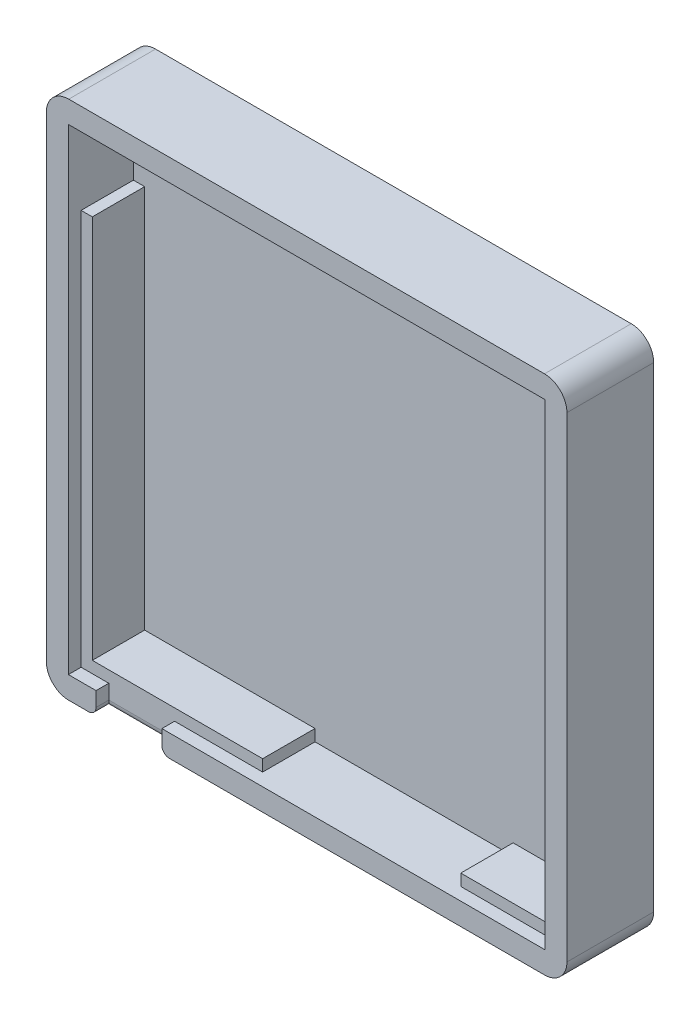
ISO-10303-21;
HEADER;
FILE_DESCRIPTION(('STEP AP214'),'2;1');
FILE_NAME('part.step','',(''),(''),'','','');
FILE_SCHEMA(('AUTOMOTIVE_DESIGN { 1 0 10303 214 1 1 1 1 }'));
ENDSEC;
DATA;
#1=APPLICATION_CONTEXT('core data for automotive mechanical design processes');
#2=APPLICATION_PROTOCOL_DEFINITION('international standard','automotive_design',2000,#1);
#3=PRODUCT_CONTEXT('',#1,'mechanical');
#4=PRODUCT('Part','Part','',(#3));
#5=PRODUCT_RELATED_PRODUCT_CATEGORY('part','',(#4));
#6=PRODUCT_DEFINITION_FORMATION('','',#4);
#7=PRODUCT_DEFINITION_CONTEXT('part definition',#1,'design');
#8=PRODUCT_DEFINITION('design','',#6,#7);
#9=PRODUCT_DEFINITION_SHAPE('','',#8);
#10=(LENGTH_UNIT() NAMED_UNIT(*) SI_UNIT(.MILLI.,.METRE.));
#11=(NAMED_UNIT(*) PLANE_ANGLE_UNIT() SI_UNIT($,.RADIAN.));
#12=(NAMED_UNIT(*) SI_UNIT($,.STERADIAN.) SOLID_ANGLE_UNIT());
#13=UNCERTAINTY_MEASURE_WITH_UNIT(LENGTH_MEASURE(1.E-05),#10,'distance_accuracy_value','');
#14=(GEOMETRIC_REPRESENTATION_CONTEXT(3) GLOBAL_UNCERTAINTY_ASSIGNED_CONTEXT((#13)) GLOBAL_UNIT_ASSIGNED_CONTEXT((#10,
#11,#12)) REPRESENTATION_CONTEXT('',''));
#15=CARTESIAN_POINT('',(0.,0.,0.));
#16=DIRECTION('',(0.,0.,1.));
#17=DIRECTION('',(1.,0.,0.));
#18=AXIS2_PLACEMENT_3D('',#15,#16,#17);
#19=CARTESIAN_POINT('',(0.,0.,9.9));
#20=DIRECTION('',(0.,0.,1.));
#21=DIRECTION('',(1.,0.,0.));
#22=AXIS2_PLACEMENT_3D('',#19,#20,#21);
#23=PLANE('',#22);
#24=DIRECTION('',(1.,0.,0.));
#25=VECTOR('',#24,1.);
#26=CARTESIAN_POINT('',(66.65,55.8474755003453,9.9));
#27=LINE('',#26,#25);
#28=CARTESIAN_POINT('',(65.15,55.8474755003453,9.9));
#29=VERTEX_POINT('',#28);
#30=CARTESIAN_POINT('',(66.65,55.8474755003453,9.9));
#31=VERTEX_POINT('',#30);
#32=EDGE_CURVE('E281',#29,#31,#27,.T.);
#33=ORIENTED_EDGE('',*,*,#32,.F.);
#34=DIRECTION('',(0.,-1.,0.));
#35=VECTOR('',#34,1.);
#36=CARTESIAN_POINT('',(65.15,65.1,9.9));
#37=LINE('',#36,#35);
#38=CARTESIAN_POINT('',(65.15,4.49999999999999,9.9));
#39=VERTEX_POINT('',#38);
#40=EDGE_CURVE('E400',#29,#39,#37,.T.);
#41=ORIENTED_EDGE('',*,*,#40,.T.);
#42=DIRECTION('',(-1.,0.,0.));
#43=VECTOR('',#42,1.);
#44=CARTESIAN_POINT('',(4.44999999999999,4.49999999999999,9.9));
#45=LINE('',#44,#43);
#46=CARTESIAN_POINT('',(53.7103472187715,4.49999999999999,9.9));
#47=VERTEX_POINT('',#46);
#48=EDGE_CURVE('E473',#39,#47,#45,.T.);
#49=ORIENTED_EDGE('',*,*,#48,.T.);
#50=DIRECTION('',(0.,1.,0.));
#51=VECTOR('',#50,1.);
#52=CARTESIAN_POINT('',(53.7103472187715,2.94999999999999,9.9));
#53=LINE('',#52,#51);
#54=CARTESIAN_POINT('',(53.7103472187715,2.94999999999999,9.9));
#55=VERTEX_POINT('',#54);
#56=EDGE_CURVE('E339',#55,#47,#53,.T.);
#57=ORIENTED_EDGE('',*,*,#56,.F.);
#58=DIRECTION('',(1.,0.,0.));
#59=VECTOR('',#58,1.);
#60=CARTESIAN_POINT('',(66.65,2.94999999999999,9.9));
#61=LINE('',#60,#59);
#62=CARTESIAN_POINT('',(66.65,2.94999999999999,9.9));
#63=VERTEX_POINT('',#62);
#64=EDGE_CURVE('E379',#55,#63,#61,.T.);
#65=ORIENTED_EDGE('',*,*,#64,.T.);
#66=DIRECTION('',(0.,1.,0.));
#67=VECTOR('',#66,1.);
#68=CARTESIAN_POINT('',(66.65,2.94999999999999,9.9));
#69=LINE('',#68,#67);
#70=EDGE_CURVE('E367',#63,#31,#69,.T.);
#71=ORIENTED_EDGE('',*,*,#70,.T.);
#72=EDGE_LOOP('',(#33,#41,#49,#57,#65,#71));
#73=FACE_BOUND('',#72,.T.);
#74=ADVANCED_FACE('F39',(#73),#23,.T.);
#75=DIRECTION('',(0.,-1.,0.));
#76=VECTOR('',#75,1.);
#77=CARTESIAN_POINT('',(56.7541359834372,66.65,9.9));
#78=LINE('',#77,#76);
#79=CARTESIAN_POINT('',(56.7541359834372,66.65,9.9));
#80=VERTEX_POINT('',#79);
#81=CARTESIAN_POINT('',(56.7541359834372,65.1,9.9));
#82=VERTEX_POINT('',#81);
#83=EDGE_CURVE('E284',#80,#82,#78,.T.);
#84=ORIENTED_EDGE('',*,*,#83,.F.);
#85=DIRECTION('',(-1.,0.,0.));
#86=VECTOR('',#85,1.);
#87=CARTESIAN_POINT('',(66.65,66.65,9.9));
#88=LINE('',#87,#86);
#89=CARTESIAN_POINT('',(13.0401484057971,66.65,9.9));
#90=VERTEX_POINT('',#89);
#91=EDGE_CURVE('E371',#80,#90,#88,.T.);
#92=ORIENTED_EDGE('',*,*,#91,.T.);
#93=DIRECTION('',(0.,1.,0.));
#94=VECTOR('',#93,1.);
#95=CARTESIAN_POINT('',(13.0401484057971,66.65,9.9));
#96=LINE('',#95,#94);
#97=CARTESIAN_POINT('',(13.0401484057971,65.1,9.9));
#98=VERTEX_POINT('',#97);
#99=EDGE_CURVE('E305',#98,#90,#96,.T.);
#100=ORIENTED_EDGE('',*,*,#99,.F.);
#101=DIRECTION('',(1.,0.,0.));
#102=VECTOR('',#101,1.);
#103=CARTESIAN_POINT('',(4.44999999999999,65.1,9.9));
#104=LINE('',#103,#102);
#105=EDGE_CURVE('E408',#98,#82,#104,.T.);
#106=ORIENTED_EDGE('',*,*,#105,.T.);
#107=EDGE_LOOP('',(#84,#92,#100,#106));
#108=FACE_BOUND('',#107,.T.);
#109=ADVANCED_FACE('F688',(#108),#23,.T.);
#110=CARTESIAN_POINT('',(4.44999999999999,4.49999999999999,2.9));
#111=DIRECTION('',(0.,-1.,0.));
#112=DIRECTION('',(0.,0.,-1.));
#113=AXIS2_PLACEMENT_3D('',#110,#111,#112);
#114=PLANE('',#113);
#115=DIRECTION('',(1.,0.,0.));
#116=VECTOR('',#115,1.);
#117=CARTESIAN_POINT('',(4.44999999999999,4.49999999999999,2.9));
#118=LINE('',#117,#116);
#119=CARTESIAN_POINT('',(53.7103472187715,4.49999999999999,2.9));
#120=VERTEX_POINT('',#119);
#121=CARTESIAN_POINT('',(65.15,4.49999999999999,2.9));
#122=VERTEX_POINT('',#121);
#123=EDGE_CURVE('E419',#120,#122,#118,.T.);
#124=ORIENTED_EDGE('',*,*,#123,.F.);
#125=DIRECTION('',(0.,0.,1.));
#126=VECTOR('',#125,1.);
#127=CARTESIAN_POINT('',(53.7103472187715,4.49999999999999,2.9));
#128=LINE('',#127,#126);
#129=EDGE_CURVE('E497',#120,#47,#128,.T.);
#130=ORIENTED_EDGE('',*,*,#129,.T.);
#131=ORIENTED_EDGE('',*,*,#48,.F.);
#132=DIRECTION('',(0.,0.,1.));
#133=VECTOR('',#132,1.);
#134=CARTESIAN_POINT('',(65.15,4.49999999999999,2.9));
#135=LINE('',#134,#133);
#136=EDGE_CURVE('E432',#122,#39,#135,.T.);
#137=ORIENTED_EDGE('',*,*,#136,.F.);
#138=EDGE_LOOP('',(#124,#130,#131,#137));
#139=FACE_BOUND('',#138,.T.);
#140=ADVANCED_FACE('F694',(#139),#114,.F.);
#141=CARTESIAN_POINT('',(66.65,2.94999999999999,9.9));
#142=DIRECTION('',(0.,-1.,0.));
#143=DIRECTION('',(1.,0.,0.));
#144=AXIS2_PLACEMENT_3D('',#141,#142,#143);
#145=PLANE('',#144);
#146=CARTESIAN_POINT('',(15.45,2.95,9.9));
#147=VERTEX_POINT('',#146);
#148=CARTESIAN_POINT('',(27.2229088198755,2.94999999999999,9.9));
#149=VERTEX_POINT('',#148);
#150=EDGE_CURVE('E383',#147,#149,#61,.T.);
#151=ORIENTED_EDGE('',*,*,#150,.F.);
#152=DIRECTION('',(0.,0.,1.));
#153=VECTOR('',#152,1.);
#154=CARTESIAN_POINT('',(15.45,2.95,9.9));
#155=LINE('',#154,#153);
#156=CARTESIAN_POINT('',(15.45,2.95,11.6));
#157=VERTEX_POINT('',#156);
#158=EDGE_CURVE('E356',#147,#157,#155,.T.);
#159=ORIENTED_EDGE('',*,*,#158,.T.);
#160=DIRECTION('',(1.,0.,0.));
#161=VECTOR('',#160,1.);
#162=CARTESIAN_POINT('',(66.65,2.94999999999999,11.6));
#163=LINE('',#162,#161);
#164=CARTESIAN_POINT('',(66.65,2.94999999999999,11.6));
#165=VERTEX_POINT('',#164);
#166=EDGE_CURVE('E393',#157,#165,#163,.T.);
#167=ORIENTED_EDGE('',*,*,#166,.T.);
#168=DIRECTION('',(0.,0.,1.));
#169=VECTOR('',#168,1.);
#170=CARTESIAN_POINT('',(66.65,2.94999999999999,9.9));
#171=LINE('',#170,#169);
#172=EDGE_CURVE('E397',#63,#165,#171,.T.);
#173=ORIENTED_EDGE('',*,*,#172,.F.);
#174=ORIENTED_EDGE('',*,*,#64,.F.);
#175=DIRECTION('',(0.,0.,1.));
#176=VECTOR('',#175,1.);
#177=CARTESIAN_POINT('',(53.7103472187715,2.94999999999999,2.9));
#178=LINE('',#177,#176);
#179=CARTESIAN_POINT('',(53.7103472187715,2.94999999999999,2.9));
#180=VERTEX_POINT('',#179);
#181=EDGE_CURVE('E319',#180,#55,#178,.T.);
#182=ORIENTED_EDGE('',*,*,#181,.F.);
#183=DIRECTION('',(1.,0.,0.));
#184=VECTOR('',#183,1.);
#185=CARTESIAN_POINT('',(53.7103472187715,2.94999999999999,2.9));
#186=LINE('',#185,#184);
#187=CARTESIAN_POINT('',(27.2229088198755,2.94999999999999,2.9));
#188=VERTEX_POINT('',#187);
#189=EDGE_CURVE('E334',#188,#180,#186,.T.);
#190=ORIENTED_EDGE('',*,*,#189,.F.);
#191=DIRECTION('',(0.,0.,1.));
#192=VECTOR('',#191,1.);
#193=CARTESIAN_POINT('',(27.2229088198755,2.94999999999999,2.9));
#194=LINE('',#193,#192);
#195=EDGE_CURVE('E338',#188,#149,#194,.T.);
#196=ORIENTED_EDGE('',*,*,#195,.T.);
#197=EDGE_LOOP('',(#151,#159,#167,#173,#174,#182,#190,#196));
#198=FACE_BOUND('',#197,.T.);
#199=ADVANCED_FACE('F718',(#198),#145,.F.);
#200=CARTESIAN_POINT('',(0.,0.,11.6));
#201=DIRECTION('',(1.,0.,0.));
#202=DIRECTION('',(0.,0.,-1.));
#203=AXIS2_PLACEMENT_3D('',#200,#201,#202);
#204=PLANE('',#203);
#205=DIRECTION('',(0.,-1.,0.));
#206=VECTOR('',#205,1.);
#207=CARTESIAN_POINT('',(0.,0.,11.6));
#208=LINE('',#207,#206);
#209=CARTESIAN_POINT('',(0.,66.6,11.6));
#210=VERTEX_POINT('',#209);
#211=CARTESIAN_POINT('',(0.,3.,11.6));
#212=VERTEX_POINT('',#211);
#213=EDGE_CURVE('E440',#210,#212,#208,.T.);
#214=ORIENTED_EDGE('',*,*,#213,.F.);
#215=DIRECTION('',(0.,0.,-1.));
#216=VECTOR('',#215,1.);
#217=CARTESIAN_POINT('',(0.,66.6,11.6));
#218=LINE('',#217,#216);
#219=CARTESIAN_POINT('',(0.,66.6,0.));
#220=VERTEX_POINT('',#219);
#221=EDGE_CURVE('E542',#210,#220,#218,.T.);
#222=ORIENTED_EDGE('',*,*,#221,.T.);
#223=DIRECTION('',(0.,-1.,0.));
#224=VECTOR('',#223,1.);
#225=CARTESIAN_POINT('',(0.,0.,0.));
#226=LINE('',#225,#224);
#227=CARTESIAN_POINT('',(0.,3.,0.));
#228=VERTEX_POINT('',#227);
#229=EDGE_CURVE('E436',#220,#228,#226,.T.);
#230=ORIENTED_EDGE('',*,*,#229,.T.);
#231=DIRECTION('',(0.,0.,-1.));
#232=VECTOR('',#231,1.);
#233=CARTESIAN_POINT('',(0.,3.,11.6));
#234=LINE('',#233,#232);
#235=EDGE_CURVE('E539',#228,#212,#234,.F.);
#236=ORIENTED_EDGE('',*,*,#235,.T.);
#237=EDGE_LOOP('',(#214,#222,#230,#236));
#238=FACE_BOUND('',#237,.T.);
#239=ADVANCED_FACE('F663',(#238),#204,.F.);
#240=CARTESIAN_POINT('',(0.,0.,11.6));
#241=DIRECTION('',(0.,1.,0.));
#242=DIRECTION('',(0.,0.,1.));
#243=AXIS2_PLACEMENT_3D('',#240,#241,#242);
#244=PLANE('',#243);
#245=DIRECTION('',(1.,0.,0.));
#246=VECTOR('',#245,1.);
#247=CARTESIAN_POINT('',(6.65,0.,8.9));
#248=LINE('',#247,#246);
#249=CARTESIAN_POINT('',(16.45,0.,8.9));
#250=VERTEX_POINT('',#249);
#251=CARTESIAN_POINT('',(5.65,0.,8.9));
#252=VERTEX_POINT('',#251);
#253=EDGE_CURVE('E557',#250,#252,#248,.F.);
#254=ORIENTED_EDGE('',*,*,#253,.T.);
#255=DIRECTION('',(0.,0.,1.));
#256=VECTOR('',#255,1.);
#257=CARTESIAN_POINT('',(5.65,0.,11.6));
#258=LINE('',#257,#256);
#259=CARTESIAN_POINT('',(5.65,0.,11.6));
#260=VERTEX_POINT('',#259);
#261=EDGE_CURVE('E560',#252,#260,#258,.T.);
#262=ORIENTED_EDGE('',*,*,#261,.T.);
#263=DIRECTION('',(1.,0.,0.));
#264=VECTOR('',#263,1.);
#265=CARTESIAN_POINT('',(0.,0.,11.6));
#266=LINE('',#265,#264);
#267=CARTESIAN_POINT('',(3.,0.,11.6));
#268=VERTEX_POINT('',#267);
#269=EDGE_CURVE('E446',#268,#260,#266,.T.);
#270=ORIENTED_EDGE('',*,*,#269,.F.);
#271=DIRECTION('',(0.,0.,-1.));
#272=VECTOR('',#271,1.);
#273=CARTESIAN_POINT('',(3.,0.,11.6));
#274=LINE('',#273,#272);
#275=CARTESIAN_POINT('',(3.,0.,0.));
#276=VERTEX_POINT('',#275);
#277=EDGE_CURVE('E550',#268,#276,#274,.T.);
#278=ORIENTED_EDGE('',*,*,#277,.T.);
#279=DIRECTION('',(1.,0.,0.));
#280=VECTOR('',#279,1.);
#281=CARTESIAN_POINT('',(0.,0.,0.));
#282=LINE('',#281,#280);
#283=CARTESIAN_POINT('',(66.6,0.,0.));
#284=VERTEX_POINT('',#283);
#285=EDGE_CURVE('E462',#276,#284,#282,.T.);
#286=ORIENTED_EDGE('',*,*,#285,.T.);
#287=DIRECTION('',(0.,0.,-1.));
#288=VECTOR('',#287,1.);
#289=CARTESIAN_POINT('',(66.6,0.,11.6));
#290=LINE('',#289,#288);
#291=CARTESIAN_POINT('',(66.6,0.,11.6));
#292=VERTEX_POINT('',#291);
#293=EDGE_CURVE('E546',#284,#292,#290,.F.);
#294=ORIENTED_EDGE('',*,*,#293,.T.);
#295=CARTESIAN_POINT('',(16.45,0.,11.6));
#296=VERTEX_POINT('',#295);
#297=EDGE_CURVE('E444',#296,#292,#266,.T.);
#298=ORIENTED_EDGE('',*,*,#297,.F.);
#299=DIRECTION('',(0.,0.,1.));
#300=VECTOR('',#299,1.);
#301=CARTESIAN_POINT('',(16.45,0.,11.6));
#302=LINE('',#301,#300);
#303=EDGE_CURVE('E554',#296,#250,#302,.F.);
#304=ORIENTED_EDGE('',*,*,#303,.T.);
#305=EDGE_LOOP('',(#254,#262,#270,#278,#286,#294,#298,#304));
#306=FACE_BOUND('',#305,.T.);
#307=ADVANCED_FACE('F639',(#306),#244,.F.);
#308=CARTESIAN_POINT('',(69.6,0.,11.6));
#309=DIRECTION('',(-1.,0.,0.));
#310=DIRECTION('',(0.,0.,1.));
#311=AXIS2_PLACEMENT_3D('',#308,#309,#310);
#312=PLANE('',#311);
#313=DIRECTION('',(0.,1.,0.));
#314=VECTOR('',#313,1.);
#315=CARTESIAN_POINT('',(69.6,0.,0.));
#316=LINE('',#315,#314);
#317=CARTESIAN_POINT('',(69.6,3.,0.));
#318=VERTEX_POINT('',#317);
#319=CARTESIAN_POINT('',(69.6,66.6,0.));
#320=VERTEX_POINT('',#319);
#321=EDGE_CURVE('E466',#318,#320,#316,.T.);
#322=ORIENTED_EDGE('',*,*,#321,.T.);
#323=DIRECTION('',(0.,0.,-1.));
#324=VECTOR('',#323,1.);
#325=CARTESIAN_POINT('',(69.6,66.6,11.6));
#326=LINE('',#325,#324);
#327=CARTESIAN_POINT('',(69.6,66.6,11.6));
#328=VERTEX_POINT('',#327);
#329=EDGE_CURVE('E524',#320,#328,#326,.F.);
#330=ORIENTED_EDGE('',*,*,#329,.T.);
#331=DIRECTION('',(0.,1.,0.));
#332=VECTOR('',#331,1.);
#333=CARTESIAN_POINT('',(69.6,0.,11.6));
#334=LINE('',#333,#332);
#335=CARTESIAN_POINT('',(69.6,3.,11.6));
#336=VERTEX_POINT('',#335);
#337=EDGE_CURVE('E450',#336,#328,#334,.T.);
#338=ORIENTED_EDGE('',*,*,#337,.F.);
#339=DIRECTION('',(0.,0.,-1.));
#340=VECTOR('',#339,1.);
#341=CARTESIAN_POINT('',(69.6,3.,11.6));
#342=LINE('',#341,#340);
#343=EDGE_CURVE('E520',#336,#318,#342,.T.);
#344=ORIENTED_EDGE('',*,*,#343,.T.);
#345=EDGE_LOOP('',(#322,#330,#338,#344));
#346=FACE_BOUND('',#345,.T.);
#347=ADVANCED_FACE('F648',(#346),#312,.F.);
#348=CARTESIAN_POINT('',(0.,69.6,11.6));
#349=DIRECTION('',(0.,-1.,0.));
#350=DIRECTION('',(0.,0.,-1.));
#351=AXIS2_PLACEMENT_3D('',#348,#349,#350);
#352=PLANE('',#351);
#353=DIRECTION('',(-1.,0.,0.));
#354=VECTOR('',#353,1.);
#355=CARTESIAN_POINT('',(0.,69.6,11.6));
#356=LINE('',#355,#354);
#357=CARTESIAN_POINT('',(66.6,69.6,11.6));
#358=VERTEX_POINT('',#357);
#359=CARTESIAN_POINT('',(3.,69.6,11.6));
#360=VERTEX_POINT('',#359);
#361=EDGE_CURVE('E454',#358,#360,#356,.T.);
#362=ORIENTED_EDGE('',*,*,#361,.F.);
#363=DIRECTION('',(0.,0.,-1.));
#364=VECTOR('',#363,1.);
#365=CARTESIAN_POINT('',(66.6,69.6,11.6));
#366=LINE('',#365,#364);
#367=CARTESIAN_POINT('',(66.6,69.6,0.));
#368=VERTEX_POINT('',#367);
#369=EDGE_CURVE('E504',#358,#368,#366,.T.);
#370=ORIENTED_EDGE('',*,*,#369,.T.);
#371=DIRECTION('',(-1.,0.,0.));
#372=VECTOR('',#371,1.);
#373=CARTESIAN_POINT('',(0.,69.6,0.));
#374=LINE('',#373,#372);
#375=CARTESIAN_POINT('',(3.,69.6,0.));
#376=VERTEX_POINT('',#375);
#377=EDGE_CURVE('E445',#368,#376,#374,.T.);
#378=ORIENTED_EDGE('',*,*,#377,.T.);
#379=DIRECTION('',(0.,0.,-1.));
#380=VECTOR('',#379,1.);
#381=CARTESIAN_POINT('',(3.,69.6,11.6));
#382=LINE('',#381,#380);
#383=EDGE_CURVE('E501',#376,#360,#382,.F.);
#384=ORIENTED_EDGE('',*,*,#383,.T.);
#385=EDGE_LOOP('',(#362,#370,#378,#384));
#386=FACE_BOUND('',#385,.T.);
#387=ADVANCED_FACE('F671',(#386),#352,.F.);
#388=CARTESIAN_POINT('',(0.,0.,11.6));
#389=DIRECTION('',(0.,0.,-1.));
#390=DIRECTION('',(-1.,0.,0.));
#391=AXIS2_PLACEMENT_3D('',#388,#389,#390);
#392=PLANE('',#391);
#393=ORIENTED_EDGE('',*,*,#269,.T.);
#394=CARTESIAN_POINT('',(5.65,1.,11.6));
#395=DIRECTION('',(0.,0.,-1.));
#396=DIRECTION('',(-1.,0.,0.));
#397=AXIS2_PLACEMENT_3D('',#394,#395,#396);
#398=CIRCLE('',#397,1.);
#399=CARTESIAN_POINT('',(6.65,1.,11.6));
#400=VERTEX_POINT('',#399);
#401=EDGE_CURVE('E567',#260,#400,#398,.F.);
#402=ORIENTED_EDGE('',*,*,#401,.T.);
#403=DIRECTION('',(0.,-1.,0.));
#404=VECTOR('',#403,1.);
#405=CARTESIAN_POINT('',(6.65,2.95,11.6));
#406=LINE('',#405,#404);
#407=CARTESIAN_POINT('',(6.65,2.95,11.6));
#408=VERTEX_POINT('',#407);
#409=EDGE_CURVE('E353',#408,#400,#406,.T.);
#410=ORIENTED_EDGE('',*,*,#409,.F.);
#411=CARTESIAN_POINT('',(2.95,2.95,11.6));
#412=VERTEX_POINT('',#411);
#413=EDGE_CURVE('E372',#412,#408,#163,.T.);
#414=ORIENTED_EDGE('',*,*,#413,.F.);
#415=DIRECTION('',(0.,-1.,0.));
#416=VECTOR('',#415,1.);
#417=CARTESIAN_POINT('',(2.95,2.95,11.6));
#418=LINE('',#417,#416);
#419=CARTESIAN_POINT('',(2.95,66.65,11.6));
#420=VERTEX_POINT('',#419);
#421=EDGE_CURVE('E389',#420,#412,#418,.T.);
#422=ORIENTED_EDGE('',*,*,#421,.F.);
#423=DIRECTION('',(-1.,0.,0.));
#424=VECTOR('',#423,1.);
#425=CARTESIAN_POINT('',(66.65,66.65,11.6));
#426=LINE('',#425,#424);
#427=CARTESIAN_POINT('',(66.65,66.65,11.6));
#428=VERTEX_POINT('',#427);
#429=EDGE_CURVE('E386',#428,#420,#426,.T.);
#430=ORIENTED_EDGE('',*,*,#429,.F.);
#431=DIRECTION('',(0.,1.,0.));
#432=VECTOR('',#431,1.);
#433=CARTESIAN_POINT('',(66.65,2.94999999999999,11.6));
#434=LINE('',#433,#432);
#435=EDGE_CURVE('E258',#165,#428,#434,.T.);
#436=ORIENTED_EDGE('',*,*,#435,.F.);
#437=ORIENTED_EDGE('',*,*,#166,.F.);
#438=DIRECTION('',(0.,1.,0.));
#439=VECTOR('',#438,1.);
#440=CARTESIAN_POINT('',(15.45,2.95,11.6));
#441=LINE('',#440,#439);
#442=CARTESIAN_POINT('',(15.45,0.999999999999999,11.6));
#443=VERTEX_POINT('',#442);
#444=EDGE_CURVE('E297',#443,#157,#441,.T.);
#445=ORIENTED_EDGE('',*,*,#444,.F.);
#446=CARTESIAN_POINT('',(16.45,1.,11.6));
#447=DIRECTION('',(0.,0.,-1.));
#448=DIRECTION('',(-1.,0.,0.));
#449=AXIS2_PLACEMENT_3D('',#446,#447,#448);
#450=CIRCLE('',#449,1.);
#451=EDGE_CURVE('E564',#443,#296,#450,.F.);
#452=ORIENTED_EDGE('',*,*,#451,.T.);
#453=ORIENTED_EDGE('',*,*,#297,.T.);
#454=CARTESIAN_POINT('',(66.6,3.,11.6));
#455=DIRECTION('',(0.,0.,-1.));
#456=DIRECTION('',(-1.,0.,0.));
#457=AXIS2_PLACEMENT_3D('',#454,#455,#456);
#458=CIRCLE('',#457,3.);
#459=EDGE_CURVE('E527',#292,#336,#458,.F.);
#460=ORIENTED_EDGE('',*,*,#459,.T.);
#461=ORIENTED_EDGE('',*,*,#337,.T.);
#462=CARTESIAN_POINT('',(66.6,66.6,11.6));
#463=DIRECTION('',(0.,0.,-1.));
#464=DIRECTION('',(-1.,0.,0.));
#465=AXIS2_PLACEMENT_3D('',#462,#463,#464);
#466=CIRCLE('',#465,3.);
#467=EDGE_CURVE('E536',#328,#358,#466,.F.);
#468=ORIENTED_EDGE('',*,*,#467,.T.);
#469=ORIENTED_EDGE('',*,*,#361,.T.);
#470=CARTESIAN_POINT('',(3.,66.6,11.6));
#471=DIRECTION('',(0.,0.,-1.));
#472=DIRECTION('',(-1.,0.,0.));
#473=AXIS2_PLACEMENT_3D('',#470,#471,#472);
#474=CIRCLE('',#473,3.);
#475=EDGE_CURVE('E533',#360,#210,#474,.F.);
#476=ORIENTED_EDGE('',*,*,#475,.T.);
#477=ORIENTED_EDGE('',*,*,#213,.T.);
#478=CARTESIAN_POINT('',(3.,3.,11.6));
#479=DIRECTION('',(0.,0.,-1.));
#480=DIRECTION('',(-1.,0.,0.));
#481=AXIS2_PLACEMENT_3D('',#478,#479,#480);
#482=CIRCLE('',#481,3.);
#483=EDGE_CURVE('E530',#212,#268,#482,.F.);
#484=ORIENTED_EDGE('',*,*,#483,.T.);
#485=EDGE_LOOP('',(#393,#402,#410,#414,#422,#430,#436,#437,#445,#452,#453,#460,#461,#468,#469,
#476,#477,#484));
#486=FACE_BOUND('',#485,.T.);
#487=ADVANCED_FACE('F595',(#486),#392,.F.);
#488=CARTESIAN_POINT('',(0.,0.,0.));
#489=DIRECTION('',(0.,0.,-1.));
#490=DIRECTION('',(-1.,0.,0.));
#491=AXIS2_PLACEMENT_3D('',#488,#489,#490);
#492=PLANE('',#491);
#493=ORIENTED_EDGE('',*,*,#377,.F.);
#494=CARTESIAN_POINT('',(66.6,66.6,0.));
#495=DIRECTION('',(0.,0.,-1.));
#496=DIRECTION('',(-1.,0.,0.));
#497=AXIS2_PLACEMENT_3D('',#494,#495,#496);
#498=CIRCLE('',#497,3.);
#499=EDGE_CURVE('E517',#368,#320,#498,.T.);
#500=ORIENTED_EDGE('',*,*,#499,.T.);
#501=ORIENTED_EDGE('',*,*,#321,.F.);
#502=CARTESIAN_POINT('',(66.6,3.,0.));
#503=DIRECTION('',(0.,0.,-1.));
#504=DIRECTION('',(-1.,0.,0.));
#505=AXIS2_PLACEMENT_3D('',#502,#503,#504);
#506=CIRCLE('',#505,3.);
#507=EDGE_CURVE('E508',#318,#284,#506,.T.);
#508=ORIENTED_EDGE('',*,*,#507,.T.);
#509=ORIENTED_EDGE('',*,*,#285,.F.);
#510=CARTESIAN_POINT('',(3.,3.,0.));
#511=DIRECTION('',(0.,0.,-1.));
#512=DIRECTION('',(-1.,0.,0.));
#513=AXIS2_PLACEMENT_3D('',#510,#511,#512);
#514=CIRCLE('',#513,3.);
#515=EDGE_CURVE('E511',#276,#228,#514,.T.);
#516=ORIENTED_EDGE('',*,*,#515,.T.);
#517=ORIENTED_EDGE('',*,*,#229,.F.);
#518=CARTESIAN_POINT('',(3.,66.6,0.));
#519=DIRECTION('',(0.,0.,-1.));
#520=DIRECTION('',(-1.,0.,0.));
#521=AXIS2_PLACEMENT_3D('',#518,#519,#520);
#522=CIRCLE('',#521,3.);
#523=EDGE_CURVE('E514',#220,#376,#522,.T.);
#524=ORIENTED_EDGE('',*,*,#523,.T.);
#525=EDGE_LOOP('',(#493,#500,#501,#508,#509,#516,#517,#524));
#526=FACE_BOUND('',#525,.T.);
#527=ADVANCED_FACE('F655',(#526),#492,.T.);
#528=DIRECTION('',(0.,-1.,0.));
#529=VECTOR('',#528,1.);
#530=CARTESIAN_POINT('',(6.65,2.95,9.9));
#531=LINE('',#530,#529);
#532=CARTESIAN_POINT('',(6.65,2.95,9.9));
#533=VERTEX_POINT('',#532);
#534=CARTESIAN_POINT('',(6.65,1.,9.9));
#535=VERTEX_POINT('',#534);
#536=EDGE_CURVE('E352',#533,#535,#531,.T.);
#537=ORIENTED_EDGE('',*,*,#536,.T.);
#538=DIRECTION('',(1.,0.,0.));
#539=VECTOR('',#538,1.);
#540=CARTESIAN_POINT('',(15.45,1.,9.9));
#541=LINE('',#540,#539);
#542=CARTESIAN_POINT('',(15.45,0.999999999999999,9.9));
#543=VERTEX_POINT('',#542);
#544=EDGE_CURVE('E49',#535,#543,#541,.T.);
#545=ORIENTED_EDGE('',*,*,#544,.T.);
#546=DIRECTION('',(0.,1.,0.));
#547=VECTOR('',#546,1.);
#548=CARTESIAN_POINT('',(15.45,2.95,9.9));
#549=LINE('',#548,#547);
#550=EDGE_CURVE('E349',#543,#147,#549,.T.);
#551=ORIENTED_EDGE('',*,*,#550,.T.);
#552=ORIENTED_EDGE('',*,*,#150,.T.);
#553=DIRECTION('',(0.,-1.,0.));
#554=VECTOR('',#553,1.);
#555=CARTESIAN_POINT('',(27.2229088198755,2.94999999999999,9.9));
#556=LINE('',#555,#554);
#557=CARTESIAN_POINT('',(27.2229088198755,4.49999999999999,9.9));
#558=VERTEX_POINT('',#557);
#559=EDGE_CURVE('E331',#558,#149,#556,.T.);
#560=ORIENTED_EDGE('',*,*,#559,.F.);
#561=CARTESIAN_POINT('',(4.44999999999999,4.49999999999999,9.9));
#562=VERTEX_POINT('',#561);
#563=EDGE_CURVE('E458',#558,#562,#45,.T.);
#564=ORIENTED_EDGE('',*,*,#563,.T.);
#565=DIRECTION('',(0.,1.,0.));
#566=VECTOR('',#565,1.);
#567=CARTESIAN_POINT('',(4.44999999999999,65.1,9.9));
#568=LINE('',#567,#566);
#569=CARTESIAN_POINT('',(4.44999999999999,55.8474755003453,9.9));
#570=VERTEX_POINT('',#569);
#571=EDGE_CURVE('E412',#562,#570,#568,.T.);
#572=ORIENTED_EDGE('',*,*,#571,.T.);
#573=DIRECTION('',(1.,0.,0.));
#574=VECTOR('',#573,1.);
#575=CARTESIAN_POINT('',(2.95,55.8474755003453,9.9));
#576=LINE('',#575,#574);
#577=CARTESIAN_POINT('',(2.95,55.8474755003453,9.9));
#578=VERTEX_POINT('',#577);
#579=EDGE_CURVE('E316',#578,#570,#576,.T.);
#580=ORIENTED_EDGE('',*,*,#579,.F.);
#581=DIRECTION('',(0.,-1.,0.));
#582=VECTOR('',#581,1.);
#583=CARTESIAN_POINT('',(2.95,2.95,9.9));
#584=LINE('',#583,#582);
#585=CARTESIAN_POINT('',(2.95,2.95,9.9));
#586=VERTEX_POINT('',#585);
#587=EDGE_CURVE('E376',#578,#586,#584,.T.);
#588=ORIENTED_EDGE('',*,*,#587,.T.);
#589=EDGE_CURVE('E264',#586,#533,#61,.T.);
#590=ORIENTED_EDGE('',*,*,#589,.T.);
#591=EDGE_LOOP('',(#537,#545,#551,#552,#560,#564,#572,#580,#588,#590));
#592=FACE_BOUND('',#591,.T.);
#593=ADVANCED_FACE('F609',(#592),#23,.T.);
#594=CARTESIAN_POINT('',(66.65,2.94999999999999,9.9));
#595=DIRECTION('',(1.,0.,0.));
#596=DIRECTION('',(0.,0.,-1.));
#597=AXIS2_PLACEMENT_3D('',#594,#595,#596);
#598=PLANE('',#597);
#599=ORIENTED_EDGE('',*,*,#435,.T.);
#600=DIRECTION('',(0.,0.,1.));
#601=VECTOR('',#600,1.);
#602=CARTESIAN_POINT('',(66.65,66.65,9.9));
#603=LINE('',#602,#601);
#604=CARTESIAN_POINT('',(66.65,66.65,2.9));
#605=VERTEX_POINT('',#604);
#606=EDGE_CURVE('E250',#605,#428,#603,.T.);
#607=ORIENTED_EDGE('',*,*,#606,.F.);
#608=DIRECTION('',(0.,1.,0.));
#609=VECTOR('',#608,1.);
#610=CARTESIAN_POINT('',(66.65,66.65,2.9));
#611=LINE('',#610,#609);
#612=CARTESIAN_POINT('',(66.65,55.8474755003453,2.9));
#613=VERTEX_POINT('',#612);
#614=EDGE_CURVE('E255',#613,#605,#611,.T.);
#615=ORIENTED_EDGE('',*,*,#614,.F.);
#616=DIRECTION('',(0.,0.,1.));
#617=VECTOR('',#616,1.);
#618=CARTESIAN_POINT('',(66.65,55.8474755003453,2.9));
#619=LINE('',#618,#617);
#620=EDGE_CURVE('E294',#613,#31,#619,.T.);
#621=ORIENTED_EDGE('',*,*,#620,.T.);
#622=ORIENTED_EDGE('',*,*,#70,.F.);
#623=ORIENTED_EDGE('',*,*,#172,.T.);
#624=EDGE_LOOP('',(#599,#607,#615,#621,#622,#623));
#625=FACE_BOUND('',#624,.T.);
#626=ADVANCED_FACE('F252',(#625),#598,.F.);
#627=ORIENTED_EDGE('',*,*,#413,.T.);
#628=DIRECTION('',(0.,0.,1.));
#629=VECTOR('',#628,1.);
#630=CARTESIAN_POINT('',(6.65,2.95,9.9));
#631=LINE('',#630,#629);
#632=EDGE_CURVE('E361',#533,#408,#631,.T.);
#633=ORIENTED_EDGE('',*,*,#632,.F.);
#634=ORIENTED_EDGE('',*,*,#589,.F.);
#635=DIRECTION('',(0.,0.,1.));
#636=VECTOR('',#635,1.);
#637=CARTESIAN_POINT('',(2.95,2.95,9.9));
#638=LINE('',#637,#636);
#639=EDGE_CURVE('E401',#586,#412,#638,.T.);
#640=ORIENTED_EDGE('',*,*,#639,.T.);
#641=EDGE_LOOP('',(#627,#633,#634,#640));
#642=FACE_BOUND('',#641,.T.);
#643=ADVANCED_FACE('F633',(#642),#145,.F.);
#644=CARTESIAN_POINT('',(2.95,2.95,9.9));
#645=DIRECTION('',(-1.,0.,0.));
#646=DIRECTION('',(0.,0.,1.));
#647=AXIS2_PLACEMENT_3D('',#644,#645,#646);
#648=PLANE('',#647);
#649=ORIENTED_EDGE('',*,*,#421,.T.);
#650=ORIENTED_EDGE('',*,*,#639,.F.);
#651=ORIENTED_EDGE('',*,*,#587,.F.);
#652=DIRECTION('',(0.,0.,1.));
#653=VECTOR('',#652,1.);
#654=CARTESIAN_POINT('',(2.95,55.8474755003453,2.9));
#655=LINE('',#654,#653);
#656=CARTESIAN_POINT('',(2.95,55.8474755003453,2.9));
#657=VERTEX_POINT('',#656);
#658=EDGE_CURVE('E315',#657,#578,#655,.T.);
#659=ORIENTED_EDGE('',*,*,#658,.F.);
#660=DIRECTION('',(0.,-1.,0.));
#661=VECTOR('',#660,1.);
#662=CARTESIAN_POINT('',(2.95,66.65,2.9));
#663=LINE('',#662,#661);
#664=CARTESIAN_POINT('',(2.95,66.65,2.9));
#665=VERTEX_POINT('',#664);
#666=EDGE_CURVE('E300',#665,#657,#663,.T.);
#667=ORIENTED_EDGE('',*,*,#666,.F.);
#668=DIRECTION('',(0.,0.,1.));
#669=VECTOR('',#668,1.);
#670=CARTESIAN_POINT('',(2.95,66.65,9.9));
#671=LINE('',#670,#669);
#672=EDGE_CURVE('E263',#665,#420,#671,.T.);
#673=ORIENTED_EDGE('',*,*,#672,.T.);
#674=EDGE_LOOP('',(#649,#650,#651,#659,#667,#673));
#675=FACE_BOUND('',#674,.T.);
#676=ADVANCED_FACE('F627',(#675),#648,.F.);
#677=CARTESIAN_POINT('',(66.65,66.65,9.9));
#678=DIRECTION('',(0.,1.,0.));
#679=DIRECTION('',(-1.,0.,0.));
#680=AXIS2_PLACEMENT_3D('',#677,#678,#679);
#681=PLANE('',#680);
#682=ORIENTED_EDGE('',*,*,#429,.T.);
#683=ORIENTED_EDGE('',*,*,#672,.F.);
#684=DIRECTION('',(-1.,0.,0.));
#685=VECTOR('',#684,1.);
#686=CARTESIAN_POINT('',(2.95,66.65,2.9));
#687=LINE('',#686,#685);
#688=CARTESIAN_POINT('',(13.0401484057971,66.65,2.9));
#689=VERTEX_POINT('',#688);
#690=EDGE_CURVE('E311',#689,#665,#687,.T.);
#691=ORIENTED_EDGE('',*,*,#690,.F.);
#692=DIRECTION('',(0.,0.,1.));
#693=VECTOR('',#692,1.);
#694=CARTESIAN_POINT('',(13.0401484057971,66.65,2.9));
#695=LINE('',#694,#693);
#696=EDGE_CURVE('E292',#689,#90,#695,.T.);
#697=ORIENTED_EDGE('',*,*,#696,.T.);
#698=ORIENTED_EDGE('',*,*,#91,.F.);
#699=DIRECTION('',(0.,0.,1.));
#700=VECTOR('',#699,1.);
#701=CARTESIAN_POINT('',(56.7541359834372,66.65,2.9));
#702=LINE('',#701,#700);
#703=CARTESIAN_POINT('',(56.7541359834372,66.65,2.9));
#704=VERTEX_POINT('',#703);
#705=EDGE_CURVE('E270',#704,#80,#702,.T.);
#706=ORIENTED_EDGE('',*,*,#705,.F.);
#707=DIRECTION('',(-1.,0.,0.));
#708=VECTOR('',#707,1.);
#709=CARTESIAN_POINT('',(66.65,66.65,2.9));
#710=LINE('',#709,#708);
#711=EDGE_CURVE('E267',#605,#704,#710,.T.);
#712=ORIENTED_EDGE('',*,*,#711,.F.);
#713=ORIENTED_EDGE('',*,*,#606,.T.);
#714=EDGE_LOOP('',(#682,#683,#691,#697,#698,#706,#712,#713));
#715=FACE_BOUND('',#714,.T.);
#716=ADVANCED_FACE('F268',(#715),#681,.F.);
#717=CARTESIAN_POINT('',(0.,0.,2.9));
#718=DIRECTION('',(0.,0.,1.));
#719=DIRECTION('',(1.,0.,0.));
#720=AXIS2_PLACEMENT_3D('',#717,#718,#719);
#721=PLANE('',#720);
#722=DIRECTION('',(0.,1.,0.));
#723=VECTOR('',#722,1.);
#724=CARTESIAN_POINT('',(65.15,65.1,2.9));
#725=LINE('',#724,#723);
#726=CARTESIAN_POINT('',(65.15,55.8474755003453,2.9));
#727=VERTEX_POINT('',#726);
#728=EDGE_CURVE('E424',#122,#727,#725,.T.);
#729=ORIENTED_EDGE('',*,*,#728,.T.);
#730=DIRECTION('',(1.,0.,0.));
#731=VECTOR('',#730,1.);
#732=CARTESIAN_POINT('',(66.65,55.8474755003453,2.9));
#733=LINE('',#732,#731);
#734=EDGE_CURVE('E278',#727,#613,#733,.T.);
#735=ORIENTED_EDGE('',*,*,#734,.T.);
#736=ORIENTED_EDGE('',*,*,#614,.T.);
#737=ORIENTED_EDGE('',*,*,#711,.T.);
#738=DIRECTION('',(0.,-1.,0.));
#739=VECTOR('',#738,1.);
#740=CARTESIAN_POINT('',(56.7541359834372,66.65,2.9));
#741=LINE('',#740,#739);
#742=CARTESIAN_POINT('',(56.7541359834372,65.1,2.9));
#743=VERTEX_POINT('',#742);
#744=EDGE_CURVE('E274',#704,#743,#741,.T.);
#745=ORIENTED_EDGE('',*,*,#744,.T.);
#746=DIRECTION('',(-1.,0.,0.));
#747=VECTOR('',#746,1.);
#748=CARTESIAN_POINT('',(4.44999999999999,65.1,2.9));
#749=LINE('',#748,#747);
#750=CARTESIAN_POINT('',(13.0401484057971,65.1,2.9));
#751=VERTEX_POINT('',#750);
#752=EDGE_CURVE('E427',#743,#751,#749,.T.);
#753=ORIENTED_EDGE('',*,*,#752,.T.);
#754=DIRECTION('',(0.,1.,0.));
#755=VECTOR('',#754,1.);
#756=CARTESIAN_POINT('',(13.0401484057971,66.65,2.9));
#757=LINE('',#756,#755);
#758=EDGE_CURVE('E308',#751,#689,#757,.T.);
#759=ORIENTED_EDGE('',*,*,#758,.T.);
#760=ORIENTED_EDGE('',*,*,#690,.T.);
#761=ORIENTED_EDGE('',*,*,#666,.T.);
#762=DIRECTION('',(1.,0.,0.));
#763=VECTOR('',#762,1.);
#764=CARTESIAN_POINT('',(2.95,55.8474755003453,2.9));
#765=LINE('',#764,#763);
#766=CARTESIAN_POINT('',(4.44999999999999,55.8474755003453,2.9));
#767=VERTEX_POINT('',#766);
#768=EDGE_CURVE('E304',#657,#767,#765,.T.);
#769=ORIENTED_EDGE('',*,*,#768,.T.);
#770=DIRECTION('',(0.,-1.,0.));
#771=VECTOR('',#770,1.);
#772=CARTESIAN_POINT('',(4.44999999999999,65.1,2.9));
#773=LINE('',#772,#771);
#774=CARTESIAN_POINT('',(4.44999999999999,4.49999999999999,2.9));
#775=VERTEX_POINT('',#774);
#776=EDGE_CURVE('E416',#767,#775,#773,.T.);
#777=ORIENTED_EDGE('',*,*,#776,.T.);
#778=CARTESIAN_POINT('',(27.2229088198755,4.49999999999999,2.9));
#779=VERTEX_POINT('',#778);
#780=EDGE_CURVE('E420',#775,#779,#118,.T.);
#781=ORIENTED_EDGE('',*,*,#780,.T.);
#782=DIRECTION('',(0.,-1.,0.));
#783=VECTOR('',#782,1.);
#784=CARTESIAN_POINT('',(27.2229088198755,2.94999999999999,2.9));
#785=LINE('',#784,#783);
#786=EDGE_CURVE('E330',#779,#188,#785,.T.);
#787=ORIENTED_EDGE('',*,*,#786,.T.);
#788=ORIENTED_EDGE('',*,*,#189,.T.);
#789=DIRECTION('',(0.,1.,0.));
#790=VECTOR('',#789,1.);
#791=CARTESIAN_POINT('',(53.7103472187715,2.94999999999999,2.9));
#792=LINE('',#791,#790);
#793=EDGE_CURVE('E327',#180,#120,#792,.T.);
#794=ORIENTED_EDGE('',*,*,#793,.T.);
#795=ORIENTED_EDGE('',*,*,#123,.T.);
#796=EDGE_LOOP('',(#729,#735,#736,#737,#745,#753,#759,#760,#761,#769,#777,#781,#787,#788,#794,#795));
#797=FACE_BOUND('',#796,.T.);
#798=ADVANCED_FACE('F277',(#797),#721,.T.);
#799=ORIENTED_EDGE('',*,*,#563,.F.);
#800=DIRECTION('',(0.,0.,-1.));
#801=VECTOR('',#800,1.);
#802=CARTESIAN_POINT('',(27.2229088198755,4.49999999999999,2.9));
#803=LINE('',#802,#801);
#804=EDGE_CURVE('E493',#558,#779,#803,.T.);
#805=ORIENTED_EDGE('',*,*,#804,.T.);
#806=ORIENTED_EDGE('',*,*,#780,.F.);
#807=DIRECTION('',(0.,0.,1.));
#808=VECTOR('',#807,1.);
#809=CARTESIAN_POINT('',(4.44999999999999,4.49999999999999,2.9));
#810=LINE('',#809,#808);
#811=EDGE_CURVE('E431',#775,#562,#810,.T.);
#812=ORIENTED_EDGE('',*,*,#811,.T.);
#813=EDGE_LOOP('',(#799,#805,#806,#812));
#814=FACE_BOUND('',#813,.T.);
#815=ADVANCED_FACE('F618',(#814),#114,.F.);
#816=CARTESIAN_POINT('',(65.15,65.1,2.9));
#817=DIRECTION('',(1.,0.,0.));
#818=DIRECTION('',(0.,0.,-1.));
#819=AXIS2_PLACEMENT_3D('',#816,#817,#818);
#820=PLANE('',#819);
#821=ORIENTED_EDGE('',*,*,#40,.F.);
#822=DIRECTION('',(0.,0.,-1.));
#823=VECTOR('',#822,1.);
#824=CARTESIAN_POINT('',(65.15,55.8474755003453,2.9));
#825=LINE('',#824,#823);
#826=EDGE_CURVE('E489',#29,#727,#825,.T.);
#827=ORIENTED_EDGE('',*,*,#826,.T.);
#828=ORIENTED_EDGE('',*,*,#728,.F.);
#829=ORIENTED_EDGE('',*,*,#136,.T.);
#830=EDGE_LOOP('',(#821,#827,#828,#829));
#831=FACE_BOUND('',#830,.T.);
#832=ADVANCED_FACE('F743',(#831),#820,.F.);
#833=CARTESIAN_POINT('',(4.44999999999999,65.1,2.9));
#834=DIRECTION('',(0.,1.,0.));
#835=DIRECTION('',(0.,0.,1.));
#836=AXIS2_PLACEMENT_3D('',#833,#834,#835);
#837=PLANE('',#836);
#838=ORIENTED_EDGE('',*,*,#752,.F.);
#839=DIRECTION('',(0.,0.,1.));
#840=VECTOR('',#839,1.);
#841=CARTESIAN_POINT('',(56.7541359834372,65.1,2.9));
#842=LINE('',#841,#840);
#843=EDGE_CURVE('E485',#743,#82,#842,.T.);
#844=ORIENTED_EDGE('',*,*,#843,.T.);
#845=ORIENTED_EDGE('',*,*,#105,.F.);
#846=DIRECTION('',(0.,0.,-1.));
#847=VECTOR('',#846,1.);
#848=CARTESIAN_POINT('',(13.0401484057971,65.1,2.9));
#849=LINE('',#848,#847);
#850=EDGE_CURVE('E481',#98,#751,#849,.T.);
#851=ORIENTED_EDGE('',*,*,#850,.T.);
#852=EDGE_LOOP('',(#838,#844,#845,#851));
#853=FACE_BOUND('',#852,.T.);
#854=ADVANCED_FACE('F740',(#853),#837,.F.);
#855=CARTESIAN_POINT('',(4.44999999999999,65.1,2.9));
#856=DIRECTION('',(-1.,0.,0.));
#857=DIRECTION('',(0.,0.,1.));
#858=AXIS2_PLACEMENT_3D('',#855,#856,#857);
#859=PLANE('',#858);
#860=ORIENTED_EDGE('',*,*,#776,.F.);
#861=DIRECTION('',(0.,0.,1.));
#862=VECTOR('',#861,1.);
#863=CARTESIAN_POINT('',(4.44999999999999,55.8474755003453,2.9));
#864=LINE('',#863,#862);
#865=EDGE_CURVE('E477',#767,#570,#864,.T.);
#866=ORIENTED_EDGE('',*,*,#865,.T.);
#867=ORIENTED_EDGE('',*,*,#571,.F.);
#868=ORIENTED_EDGE('',*,*,#811,.F.);
#869=EDGE_LOOP('',(#860,#866,#867,#868));
#870=FACE_BOUND('',#869,.T.);
#871=ADVANCED_FACE('F615',(#870),#859,.F.);
#872=CARTESIAN_POINT('',(15.45,2.95,9.9));
#873=DIRECTION('',(1.,0.,0.));
#874=DIRECTION('',(0.,1.,0.));
#875=AXIS2_PLACEMENT_3D('',#872,#873,#874);
#876=PLANE('',#875);
#877=ORIENTED_EDGE('',*,*,#550,.F.);
#878=DIRECTION('',(0.,0.,1.));
#879=VECTOR('',#878,1.);
#880=CARTESIAN_POINT('',(15.45,0.999999999999999,9.9));
#881=LINE('',#880,#879);
#882=EDGE_CURVE('E11',#543,#443,#881,.T.);
#883=ORIENTED_EDGE('',*,*,#882,.T.);
#884=ORIENTED_EDGE('',*,*,#444,.T.);
#885=ORIENTED_EDGE('',*,*,#158,.F.);
#886=EDGE_LOOP('',(#877,#883,#884,#885));
#887=FACE_BOUND('',#886,.T.);
#888=ADVANCED_FACE('F591',(#887),#876,.F.);
#889=CARTESIAN_POINT('',(6.65,2.95,9.9));
#890=DIRECTION('',(-1.,0.,0.));
#891=DIRECTION('',(0.,-1.,0.));
#892=AXIS2_PLACEMENT_3D('',#889,#890,#891);
#893=PLANE('',#892);
#894=ORIENTED_EDGE('',*,*,#409,.T.);
#895=DIRECTION('',(0.,0.,1.));
#896=VECTOR('',#895,1.);
#897=CARTESIAN_POINT('',(6.65,1.,9.9));
#898=LINE('',#897,#896);
#899=EDGE_CURVE('E64',#400,#535,#898,.F.);
#900=ORIENTED_EDGE('',*,*,#899,.T.);
#901=ORIENTED_EDGE('',*,*,#536,.F.);
#902=ORIENTED_EDGE('',*,*,#632,.T.);
#903=EDGE_LOOP('',(#894,#900,#901,#902));
#904=FACE_BOUND('',#903,.T.);
#905=ADVANCED_FACE('F634',(#904),#893,.F.);
#906=CARTESIAN_POINT('',(13.0401484057971,66.65,2.9));
#907=DIRECTION('',(1.,0.,0.));
#908=DIRECTION('',(0.,0.,-1.));
#909=AXIS2_PLACEMENT_3D('',#906,#907,#908);
#910=PLANE('',#909);
#911=ORIENTED_EDGE('',*,*,#99,.T.);
#912=ORIENTED_EDGE('',*,*,#696,.F.);
#913=ORIENTED_EDGE('',*,*,#758,.F.);
#914=ORIENTED_EDGE('',*,*,#850,.F.);
#915=EDGE_LOOP('',(#911,#912,#913,#914));
#916=FACE_BOUND('',#915,.T.);
#917=ADVANCED_FACE('F755',(#916),#910,.F.);
#918=CARTESIAN_POINT('',(2.95,55.8474755003453,2.9));
#919=DIRECTION('',(0.,-1.,0.));
#920=DIRECTION('',(0.,0.,-1.));
#921=AXIS2_PLACEMENT_3D('',#918,#919,#920);
#922=PLANE('',#921);
#923=ORIENTED_EDGE('',*,*,#768,.F.);
#924=ORIENTED_EDGE('',*,*,#658,.T.);
#925=ORIENTED_EDGE('',*,*,#579,.T.);
#926=ORIENTED_EDGE('',*,*,#865,.F.);
#927=EDGE_LOOP('',(#923,#924,#925,#926));
#928=FACE_BOUND('',#927,.T.);
#929=ADVANCED_FACE('F623',(#928),#922,.F.);
#930=CARTESIAN_POINT('',(66.65,55.8474755003453,2.9));
#931=DIRECTION('',(0.,-1.,0.));
#932=DIRECTION('',(0.,0.,-1.));
#933=AXIS2_PLACEMENT_3D('',#930,#931,#932);
#934=PLANE('',#933);
#935=ORIENTED_EDGE('',*,*,#32,.T.);
#936=ORIENTED_EDGE('',*,*,#620,.F.);
#937=ORIENTED_EDGE('',*,*,#734,.F.);
#938=ORIENTED_EDGE('',*,*,#826,.F.);
#939=EDGE_LOOP('',(#935,#936,#937,#938));
#940=FACE_BOUND('',#939,.T.);
#941=ADVANCED_FACE('F764',(#940),#934,.F.);
#942=CARTESIAN_POINT('',(56.7541359834372,66.65,2.9));
#943=DIRECTION('',(-1.,0.,0.));
#944=DIRECTION('',(0.,0.,1.));
#945=AXIS2_PLACEMENT_3D('',#942,#943,#944);
#946=PLANE('',#945);
#947=ORIENTED_EDGE('',*,*,#744,.F.);
#948=ORIENTED_EDGE('',*,*,#705,.T.);
#949=ORIENTED_EDGE('',*,*,#83,.T.);
#950=ORIENTED_EDGE('',*,*,#843,.F.);
#951=EDGE_LOOP('',(#947,#948,#949,#950));
#952=FACE_BOUND('',#951,.T.);
#953=ADVANCED_FACE('F759',(#952),#946,.F.);
#954=CARTESIAN_POINT('',(53.7103472187715,2.94999999999999,2.9));
#955=DIRECTION('',(1.,0.,0.));
#956=DIRECTION('',(0.,0.,-1.));
#957=AXIS2_PLACEMENT_3D('',#954,#955,#956);
#958=PLANE('',#957);
#959=ORIENTED_EDGE('',*,*,#793,.F.);
#960=ORIENTED_EDGE('',*,*,#181,.T.);
#961=ORIENTED_EDGE('',*,*,#56,.T.);
#962=ORIENTED_EDGE('',*,*,#129,.F.);
#963=EDGE_LOOP('',(#959,#960,#961,#962));
#964=FACE_BOUND('',#963,.T.);
#965=ADVANCED_FACE('F683',(#964),#958,.F.);
#966=CARTESIAN_POINT('',(27.2229088198755,2.94999999999999,2.9));
#967=DIRECTION('',(-1.,0.,0.));
#968=DIRECTION('',(0.,0.,1.));
#969=AXIS2_PLACEMENT_3D('',#966,#967,#968);
#970=PLANE('',#969);
#971=ORIENTED_EDGE('',*,*,#559,.T.);
#972=ORIENTED_EDGE('',*,*,#195,.F.);
#973=ORIENTED_EDGE('',*,*,#786,.F.);
#974=ORIENTED_EDGE('',*,*,#804,.F.);
#975=EDGE_LOOP('',(#971,#972,#973,#974));
#976=FACE_BOUND('',#975,.T.);
#977=ADVANCED_FACE('F676',(#976),#970,.F.);
#978=CARTESIAN_POINT('',(66.6,66.6,11.6));
#979=DIRECTION('',(0.,0.,-1.));
#980=DIRECTION('',(-1.,0.,0.));
#981=AXIS2_PLACEMENT_3D('',#978,#979,#980);
#982=CYLINDRICAL_SURFACE('',#981,3.);
#983=ORIENTED_EDGE('',*,*,#467,.F.);
#984=ORIENTED_EDGE('',*,*,#329,.F.);
#985=ORIENTED_EDGE('',*,*,#499,.F.);
#986=ORIENTED_EDGE('',*,*,#369,.F.);
#987=EDGE_LOOP('',(#983,#984,#985,#986));
#988=FACE_BOUND('',#987,.T.);
#989=ADVANCED_FACE('F674',(#988),#982,.T.);
#990=CARTESIAN_POINT('',(3.,66.6,11.6));
#991=DIRECTION('',(0.,0.,-1.));
#992=DIRECTION('',(-1.,0.,0.));
#993=AXIS2_PLACEMENT_3D('',#990,#991,#992);
#994=CYLINDRICAL_SURFACE('',#993,3.);
#995=ORIENTED_EDGE('',*,*,#475,.F.);
#996=ORIENTED_EDGE('',*,*,#383,.F.);
#997=ORIENTED_EDGE('',*,*,#523,.F.);
#998=ORIENTED_EDGE('',*,*,#221,.F.);
#999=EDGE_LOOP('',(#995,#996,#997,#998));
#1000=FACE_BOUND('',#999,.T.);
#1001=ADVANCED_FACE('F667',(#1000),#994,.T.);
#1002=CARTESIAN_POINT('',(3.,3.,11.6));
#1003=DIRECTION('',(0.,0.,-1.));
#1004=DIRECTION('',(-1.,0.,0.));
#1005=AXIS2_PLACEMENT_3D('',#1002,#1003,#1004);
#1006=CYLINDRICAL_SURFACE('',#1005,3.);
#1007=ORIENTED_EDGE('',*,*,#483,.F.);
#1008=ORIENTED_EDGE('',*,*,#235,.F.);
#1009=ORIENTED_EDGE('',*,*,#515,.F.);
#1010=ORIENTED_EDGE('',*,*,#277,.F.);
#1011=EDGE_LOOP('',(#1007,#1008,#1009,#1010));
#1012=FACE_BOUND('',#1011,.T.);
#1013=ADVANCED_FACE('F658',(#1012),#1006,.T.);
#1014=CARTESIAN_POINT('',(66.6,3.,11.6));
#1015=DIRECTION('',(0.,0.,-1.));
#1016=DIRECTION('',(-1.,0.,0.));
#1017=AXIS2_PLACEMENT_3D('',#1014,#1015,#1016);
#1018=CYLINDRICAL_SURFACE('',#1017,3.);
#1019=ORIENTED_EDGE('',*,*,#459,.F.);
#1020=ORIENTED_EDGE('',*,*,#293,.F.);
#1021=ORIENTED_EDGE('',*,*,#507,.F.);
#1022=ORIENTED_EDGE('',*,*,#343,.F.);
#1023=EDGE_LOOP('',(#1019,#1020,#1021,#1022));
#1024=FACE_BOUND('',#1023,.T.);
#1025=ADVANCED_FACE('F651',(#1024),#1018,.T.);
#1026=CARTESIAN_POINT('',(16.45,1.,9.9));
#1027=DIRECTION('',(0.,0.,1.));
#1028=DIRECTION('',(1.,0.,0.));
#1029=AXIS2_PLACEMENT_3D('',#1026,#1027,#1028);
#1030=CYLINDRICAL_SURFACE('',#1029,1.);
#1031=ORIENTED_EDGE('',*,*,#451,.F.);
#1032=ORIENTED_EDGE('',*,*,#882,.F.);
#1033=CARTESIAN_POINT('',(16.45,1.,8.9));
#1034=DIRECTION('',(-0.707106781186547,0.,-0.707106781186547));
#1035=DIRECTION('',(-0.707106781186547,0.,0.707106781186547));
#1036=AXIS2_PLACEMENT_3D('',#1033,#1034,#1035);
#1037=ELLIPSE('',#1036,1.41421356237309,1.);
#1038=EDGE_CURVE('E43',#250,#543,#1037,.T.);
#1039=ORIENTED_EDGE('',*,*,#1038,.F.);
#1040=ORIENTED_EDGE('',*,*,#303,.F.);
#1041=EDGE_LOOP('',(#1031,#1032,#1039,#1040));
#1042=FACE_BOUND('',#1041,.T.);
#1043=ADVANCED_FACE('F41',(#1042),#1030,.T.);
#1044=CARTESIAN_POINT('',(0.,1.,8.9));
#1045=DIRECTION('',(-1.,0.,0.));
#1046=DIRECTION('',(0.,0.,1.));
#1047=AXIS2_PLACEMENT_3D('',#1044,#1045,#1046);
#1048=CYLINDRICAL_SURFACE('',#1047,1.);
#1049=ORIENTED_EDGE('',*,*,#1038,.T.);
#1050=ORIENTED_EDGE('',*,*,#544,.F.);
#1051=CARTESIAN_POINT('',(5.65,1.,8.9));
#1052=DIRECTION('',(-0.707106781186547,0.,0.707106781186547));
#1053=DIRECTION('',(0.707106781186547,0.,0.707106781186547));
#1054=AXIS2_PLACEMENT_3D('',#1051,#1052,#1053);
#1055=ELLIPSE('',#1054,1.41421356237309,1.);
#1056=EDGE_CURVE('E573',#252,#535,#1055,.T.);
#1057=ORIENTED_EDGE('',*,*,#1056,.F.);
#1058=ORIENTED_EDGE('',*,*,#253,.F.);
#1059=EDGE_LOOP('',(#1049,#1050,#1057,#1058));
#1060=FACE_BOUND('',#1059,.T.);
#1061=ADVANCED_FACE('F584',(#1060),#1048,.T.);
#1062=CARTESIAN_POINT('',(5.65,1.,11.6));
#1063=DIRECTION('',(0.,0.,1.));
#1064=DIRECTION('',(1.,0.,0.));
#1065=AXIS2_PLACEMENT_3D('',#1062,#1063,#1064);
#1066=CYLINDRICAL_SURFACE('',#1065,1.);
#1067=ORIENTED_EDGE('',*,*,#1056,.T.);
#1068=ORIENTED_EDGE('',*,*,#899,.F.);
#1069=ORIENTED_EDGE('',*,*,#401,.F.);
#1070=ORIENTED_EDGE('',*,*,#261,.F.);
#1071=EDGE_LOOP('',(#1067,#1068,#1069,#1070));
#1072=FACE_BOUND('',#1071,.T.);
#1073=ADVANCED_FACE('F637',(#1072),#1066,.T.);
#1074=CLOSED_SHELL('',(#74,#109,#140,#199,#239,#307,#347,#387,#487,#527,#593,#626,#643,#676,
#716,#798,#815,#832,#854,#871,#888,#905,#917,#929,#941,#953,#965,#977,#989,#1001,#1013,#1025,
#1043,#1061,#1073));
#1075=MANIFOLD_SOLID_BREP('B2',#1074);
#1076=ADVANCED_BREP_SHAPE_REPRESENTATION('',(#18,#1075),#14);
#1077=SHAPE_DEFINITION_REPRESENTATION(#9,#1076);
ENDSEC;
END-ISO-10303-21;
